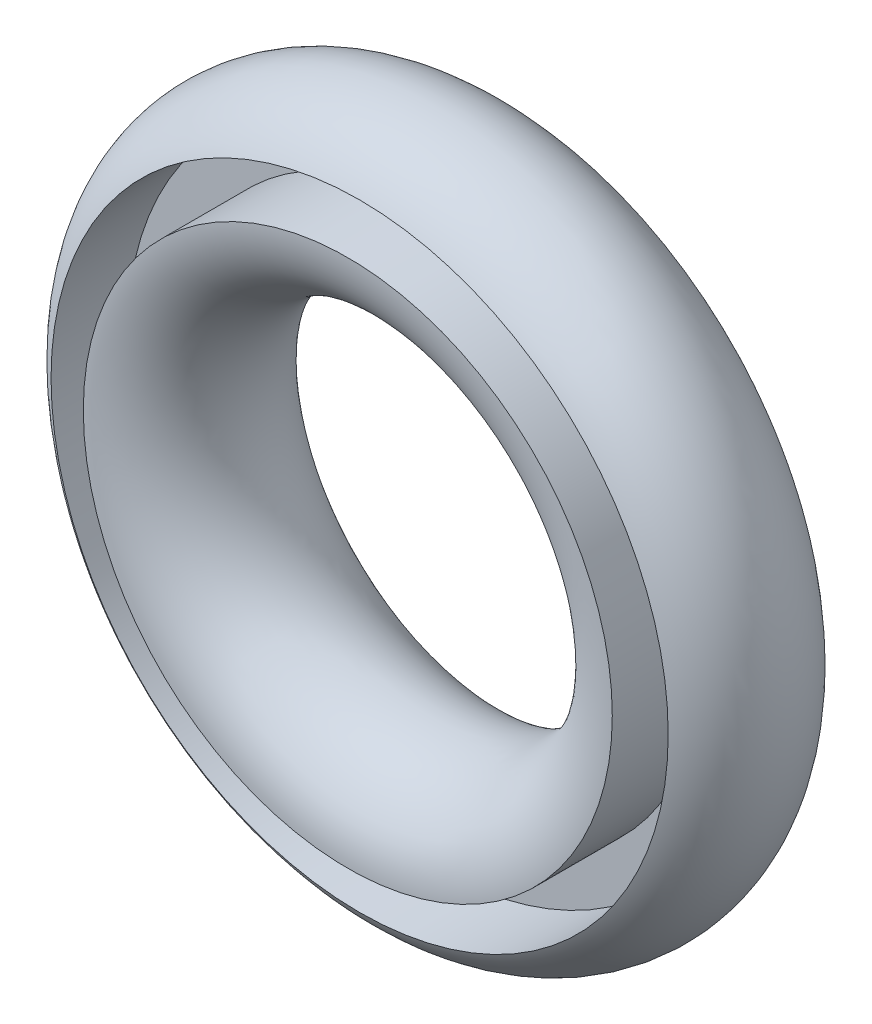
ISO-10303-21;
HEADER;
FILE_DESCRIPTION(('STEP AP214'),'2;1');
FILE_NAME('part.step','',(''),(''),'','','');
FILE_SCHEMA(('AUTOMOTIVE_DESIGN { 1 0 10303 214 1 1 1 1 }'));
ENDSEC;
DATA;
#1=APPLICATION_CONTEXT('core data for automotive mechanical design processes');
#2=APPLICATION_PROTOCOL_DEFINITION('international standard','automotive_design',2000,#1);
#3=PRODUCT_CONTEXT('',#1,'mechanical');
#4=PRODUCT('Part','Part','',(#3));
#5=PRODUCT_RELATED_PRODUCT_CATEGORY('part','',(#4));
#6=PRODUCT_DEFINITION_FORMATION('','',#4);
#7=PRODUCT_DEFINITION_CONTEXT('part definition',#1,'design');
#8=PRODUCT_DEFINITION('design','',#6,#7);
#9=PRODUCT_DEFINITION_SHAPE('','',#8);
#10=(LENGTH_UNIT() NAMED_UNIT(*) SI_UNIT(.MILLI.,.METRE.));
#11=(NAMED_UNIT(*) PLANE_ANGLE_UNIT() SI_UNIT($,.RADIAN.));
#12=(NAMED_UNIT(*) SI_UNIT($,.STERADIAN.) SOLID_ANGLE_UNIT());
#13=UNCERTAINTY_MEASURE_WITH_UNIT(LENGTH_MEASURE(1.E-05),#10,'distance_accuracy_value','');
#14=(GEOMETRIC_REPRESENTATION_CONTEXT(3) GLOBAL_UNCERTAINTY_ASSIGNED_CONTEXT((#13)) GLOBAL_UNIT_ASSIGNED_CONTEXT((#10,
#11,#12)) REPRESENTATION_CONTEXT('',''));
#15=CARTESIAN_POINT('',(0.,0.,0.));
#16=DIRECTION('',(0.,0.,1.));
#17=DIRECTION('',(1.,0.,0.));
#18=AXIS2_PLACEMENT_3D('',#15,#16,#17);
#19=CARTESIAN_POINT('',(0.,0.,-9.92321343172228));
#20=DIRECTION('',(0.,0.,-1.));
#21=DIRECTION('',(-1.,0.,0.));
#22=AXIS2_PLACEMENT_3D('',#19,#20,#21);
#23=CYLINDRICAL_SURFACE('',#22,17.5);
#24=CARTESIAN_POINT('',(0.,0.,4.3301270189222));
#25=DIRECTION('',(0.,0.,-1.));
#26=DIRECTION('',(-1.,0.,0.));
#27=AXIS2_PLACEMENT_3D('',#24,#25,#26);
#28=CIRCLE('',#27,17.5);
#29=CARTESIAN_POINT('',(-17.5,0.,4.3301270189222));
#30=VERTEX_POINT('',#29);
#31=EDGE_CURVE('E10',#30,#30,#28,.T.);
#32=ORIENTED_EDGE('',*,*,#31,.F.);
#33=EDGE_LOOP('',(#32));
#34=FACE_BOUND('',#33,.T.);
#35=CARTESIAN_POINT('',(0.,0.,0.));
#36=DIRECTION('',(0.,0.,-1.));
#37=DIRECTION('',(-1.,0.,0.));
#38=AXIS2_PLACEMENT_3D('',#35,#36,#37);
#39=CIRCLE('',#38,17.5);
#40=CARTESIAN_POINT('',(-17.5,0.,0.));
#41=VERTEX_POINT('',#40);
#42=EDGE_CURVE('E54',#41,#41,#39,.T.);
#43=ORIENTED_EDGE('',*,*,#42,.T.);
#44=EDGE_LOOP('',(#43));
#45=FACE_BOUND('',#44,.T.);
#46=ADVANCED_FACE('F37',(#34,#45),#23,.F.);
#47=CARTESIAN_POINT('',(0.,0.,0.));
#48=DIRECTION('',(0.,0.,-1.));
#49=DIRECTION('',(-1.,0.,0.));
#50=AXIS2_PLACEMENT_3D('',#47,#48,#49);
#51=TOROIDAL_SURFACE('',#50,15.,5.);
#52=CARTESIAN_POINT('',(0.,0.,5.));
#53=DIRECTION('',(0.,0.,-1.));
#54=DIRECTION('',(-1.,0.,0.));
#55=AXIS2_PLACEMENT_3D('',#52,#53,#54);
#56=CIRCLE('',#55,15.);
#57=CARTESIAN_POINT('',(-15.,0.,5.));
#58=VERTEX_POINT('',#57);
#59=EDGE_CURVE('E44',#58,#58,#56,.T.);
#60=ORIENTED_EDGE('',*,*,#59,.F.);
#61=EDGE_LOOP('',(#60));
#62=FACE_BOUND('',#61,.T.);
#63=ORIENTED_EDGE('',*,*,#31,.T.);
#64=EDGE_LOOP('',(#63));
#65=FACE_BOUND('',#64,.T.);
#66=ADVANCED_FACE('F70',(#62,#65),#51,.T.);
#67=CARTESIAN_POINT('',(0.,0.,-9.92321343172228));
#68=DIRECTION('',(0.,0.,-1.));
#69=DIRECTION('',(-1.,0.,0.));
#70=AXIS2_PLACEMENT_3D('',#67,#68,#69);
#71=CYLINDRICAL_SURFACE('',#70,15.);
#72=ORIENTED_EDGE('',*,*,#59,.T.);
#73=EDGE_LOOP('',(#72));
#74=FACE_BOUND('',#73,.T.);
#75=CARTESIAN_POINT('',(0.,0.,0.));
#76=DIRECTION('',(0.,0.,-1.));
#77=DIRECTION('',(-1.,0.,0.));
#78=AXIS2_PLACEMENT_3D('',#75,#76,#77);
#79=CIRCLE('',#78,15.);
#80=CARTESIAN_POINT('',(-15.,0.,0.));
#81=VERTEX_POINT('',#80);
#82=EDGE_CURVE('E49',#81,#81,#79,.T.);
#83=ORIENTED_EDGE('',*,*,#82,.F.);
#84=EDGE_LOOP('',(#83));
#85=FACE_BOUND('',#84,.T.);
#86=ADVANCED_FACE('F65',(#74,#85),#71,.T.);
#87=CARTESIAN_POINT('',(0.,0.,0.));
#88=DIRECTION('',(0.,0.,-1.));
#89=DIRECTION('',(-1.,0.,0.));
#90=AXIS2_PLACEMENT_3D('',#87,#88,#89);
#91=PLANE('',#90);
#92=ORIENTED_EDGE('',*,*,#42,.F.);
#93=EDGE_LOOP('',(#92));
#94=FACE_BOUND('',#93,.T.);
#95=ORIENTED_EDGE('',*,*,#82,.T.);
#96=EDGE_LOOP('',(#95));
#97=FACE_BOUND('',#96,.T.);
#98=ADVANCED_FACE('F62',(#94,#97),#91,.F.);
#99=CLOSED_SHELL('',(#46,#66,#86,#98));
#100=MANIFOLD_SOLID_BREP('B2',#99);
#101=ADVANCED_BREP_SHAPE_REPRESENTATION('',(#18,#100),#14);
#102=SHAPE_DEFINITION_REPRESENTATION(#9,#101);
ENDSEC;
END-ISO-10303-21;
